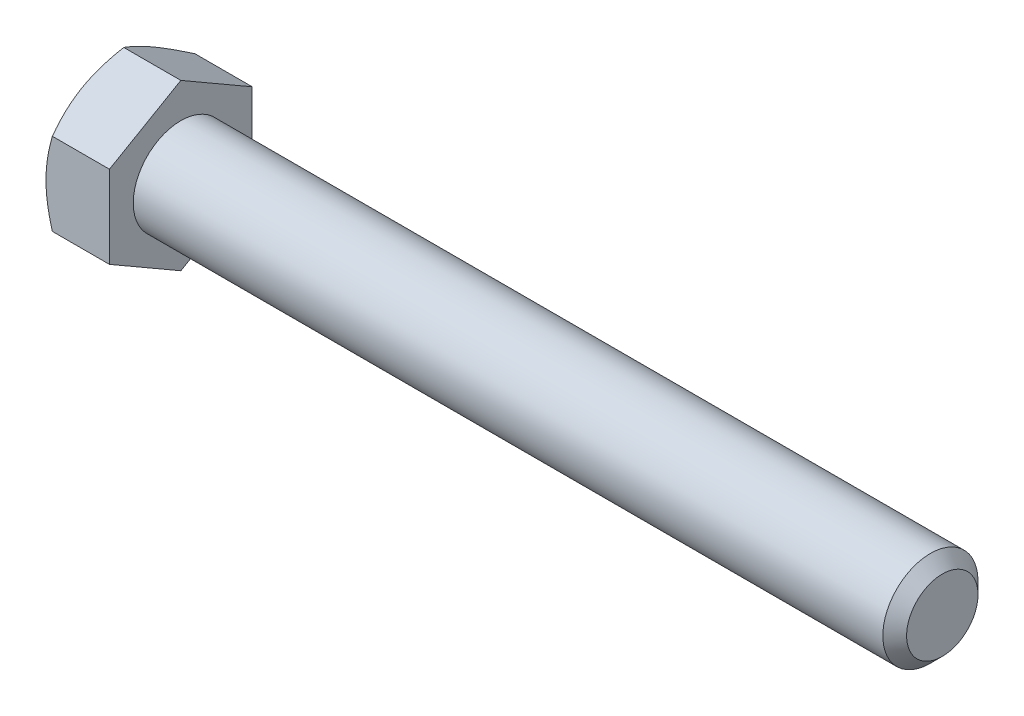
ISO-10303-21;
HEADER;
FILE_DESCRIPTION(('STEP AP214'),'2;1');
FILE_NAME('part.step','',(''),(''),'','','');
FILE_SCHEMA(('AUTOMOTIVE_DESIGN { 1 0 10303 214 1 1 1 1 }'));
ENDSEC;
DATA;
#1=APPLICATION_CONTEXT('core data for automotive mechanical design processes');
#2=APPLICATION_PROTOCOL_DEFINITION('international standard','automotive_design',2000,#1);
#3=PRODUCT_CONTEXT('',#1,'mechanical');
#4=PRODUCT('Part','Part','',(#3));
#5=PRODUCT_RELATED_PRODUCT_CATEGORY('part','',(#4));
#6=PRODUCT_DEFINITION_FORMATION('','',#4);
#7=PRODUCT_DEFINITION_CONTEXT('part definition',#1,'design');
#8=PRODUCT_DEFINITION('design','',#6,#7);
#9=PRODUCT_DEFINITION_SHAPE('','',#8);
#10=(LENGTH_UNIT() NAMED_UNIT(*) SI_UNIT(.MILLI.,.METRE.));
#11=(NAMED_UNIT(*) PLANE_ANGLE_UNIT() SI_UNIT($,.RADIAN.));
#12=(NAMED_UNIT(*) SI_UNIT($,.STERADIAN.) SOLID_ANGLE_UNIT());
#13=UNCERTAINTY_MEASURE_WITH_UNIT(LENGTH_MEASURE(1.E-05),#10,'distance_accuracy_value','');
#14=(GEOMETRIC_REPRESENTATION_CONTEXT(3) GLOBAL_UNCERTAINTY_ASSIGNED_CONTEXT((#13)) GLOBAL_UNIT_ASSIGNED_CONTEXT((#10,
#11,#12)) REPRESENTATION_CONTEXT('',''));
#15=CARTESIAN_POINT('',(0.,0.,0.));
#16=DIRECTION('',(0.,0.,1.));
#17=DIRECTION('',(1.,0.,0.));
#18=AXIS2_PLACEMENT_3D('',#15,#16,#17);
#19=CARTESIAN_POINT('',(-41.2749999999999,-4.12444598552303,7.14374999999942));
#20=DIRECTION('',(0.,0.,-1.));
#21=DIRECTION('',(0.,1.00000000000002,0.));
#22=AXIS2_PLACEMENT_3D('',#19,#20,#21);
#23=PLANE('',#22);
#24=CARTESIAN_POINT('',(-37.6837107291255,-11.2944476437765,7.14374999999959));
#25=CARTESIAN_POINT('',(-37.8368470181612,-10.9805232394076,7.14374999999949));
#26=CARTESIAN_POINT('',(-37.98857594162,-10.6659008872168,7.14374999999945));
#27=CARTESIAN_POINT('',(-38.2884314864201,-10.0348898213435,7.14374999999943));
#28=CARTESIAN_POINT('',(-38.4365575792034,-9.71850085675981,7.14374999999943));
#29=CARTESIAN_POINT('',(-38.7291194579079,-9.08205743380548,7.14374999999944));
#30=CARTESIAN_POINT('',(-38.8735325502159,-8.76199250898865,7.14374999999944));
#31=CARTESIAN_POINT('',(-39.156729056574,-8.11939096179736,7.14374999999943));
#32=CARTESIAN_POINT('',(-39.2955127230965,-7.79685445104332,7.14374999999943));
#33=CARTESIAN_POINT('',(-39.5706162676197,-7.13766604016638,7.14374999999943));
#34=CARTESIAN_POINT('',(-39.706687685096,-6.80090989506943,7.14374999999943));
#35=CARTESIAN_POINT('',(-39.9690446569591,-6.12353919008628,7.14374999999943));
#36=CARTESIAN_POINT('',(-40.0953291440824,-5.78292421402414,7.14374999999942));
#37=CARTESIAN_POINT('',(-40.3349543305283,-5.09786024749846,7.14374999999943));
#38=CARTESIAN_POINT('',(-40.4483194563628,-4.75341989048778,7.14374999999944));
#39=CARTESIAN_POINT('',(-40.6586129161924,-4.05961513378702,7.1437499999994));
#40=CARTESIAN_POINT('',(-40.7555462033471,-3.71025225244295,7.14374999999937));
#41=CARTESIAN_POINT('',(-40.9279472656945,-3.0082907051325,7.14374999999937));
#42=CARTESIAN_POINT('',(-41.0035368409943,-2.65572276057834,7.1437499999994));
#43=CARTESIAN_POINT('',(-41.0977473017323,-2.1234946201424,7.14374999999942));
#44=CARTESIAN_POINT('',(-41.1259563298877,-1.94551103747597,7.14374999999941));
#45=CARTESIAN_POINT('',(-41.1754356720996,-1.58858869612653,7.14374999999941));
#46=CARTESIAN_POINT('',(-41.1967066947933,-1.40965003689224,7.14374999999941));
#47=CARTESIAN_POINT('',(-41.231607916766,-1.05348730697556,7.14374999999941));
#48=CARTESIAN_POINT('',(-41.245338274907,-0.876273093939495,7.1437499999994));
#49=CARTESIAN_POINT('',(-41.2652847155614,-0.521422092230687,7.14374999999941));
#50=CARTESIAN_POINT('',(-41.2715009289902,-0.343785310974173,7.14374999999942));
#51=CARTESIAN_POINT('',(-41.2762697532723,0.0115936241288432,7.14374999999939));
#52=CARTESIAN_POINT('',(-41.2748223313716,0.189335778422458,7.14374999999936));
#53=CARTESIAN_POINT('',(-41.2643014350507,0.544596189801067,7.14374999999944));
#54=CARTESIAN_POINT('',(-41.2552276208028,0.722114436555852,7.14374999999954));
#55=CARTESIAN_POINT('',(-41.2249195257371,1.14231672690758,7.14374999999958));
#56=CARTESIAN_POINT('',(-41.2004249010898,1.38477115846025,7.14374999999945));
#57=CARTESIAN_POINT('',(-41.1384979515934,1.86800860978019,7.14374999999934));
#58=CARTESIAN_POINT('',(-41.1010640485556,2.10879142200594,7.14374999999938));
#59=CARTESIAN_POINT('',(-40.9713280647366,2.82827840354016,7.14374999999943));
#60=CARTESIAN_POINT('',(-40.8616106087777,3.3038910668914,7.1437499999994));
#61=CARTESIAN_POINT('',(-40.6696836999775,4.01550298491677,7.14374999999938));
#62=CARTESIAN_POINT('',(-40.6001876580382,4.25514454863067,7.14374999999937));
#63=CARTESIAN_POINT('',(-40.45356361256,4.73210450574067,7.14374999999939));
#64=CARTESIAN_POINT('',(-40.376435548635,4.96942288073888,7.14374999999942));
#65=CARTESIAN_POINT('',(-40.2158189394426,5.44180614696596,7.14374999999934));
#66=CARTESIAN_POINT('',(-40.1323321060847,5.67687162566812,7.14374999999924));
#67=CARTESIAN_POINT('',(-39.9600214111277,6.14502503891593,7.14374999999951));
#68=CARTESIAN_POINT('',(-39.8711976818889,6.37811302234187,7.14374999999989));
#69=CARTESIAN_POINT('',(-39.620948189305,7.01633974983241,7.1437500000002));
#70=CARTESIAN_POINT('',(-39.4549401417686,7.41968025407103,7.14374999999959));
#71=CARTESIAN_POINT('',(-39.1128746766822,8.22209357946195,7.14374999999914));
#72=CARTESIAN_POINT('',(-38.9368160495418,8.62116588004319,7.1437499999993));
#73=CARTESIAN_POINT('',(-38.5770756305019,9.41604681837696,7.14374999999942));
#74=CARTESIAN_POINT('',(-38.3933907130704,9.81185403670943,7.14374999999937));
#75=CARTESIAN_POINT('',(-38.0202597306572,10.6007123172169,7.14374999999933));
#76=CARTESIAN_POINT('',(-37.8308139221847,10.9937635011508,7.14374999999934));
#77=CARTESIAN_POINT('',(-37.4471131080571,11.7783335003951,7.14374999999935));
#78=CARTESIAN_POINT('',(-37.252850485674,12.1698485826149,7.14374999999934));
#79=CARTESIAN_POINT('',(-36.8607727676531,12.95109726537,7.14374999999933));
#80=CARTESIAN_POINT('',(-36.6629576395824,13.3408308496001,7.14374999999933));
#81=CARTESIAN_POINT('',(-36.2645317877318,14.11874726817,7.14374999999933));
#82=CARTESIAN_POINT('',(-36.0639217421807,14.5069304503019,7.14374999999933));
#83=CARTESIAN_POINT('',(-35.6603913196845,15.28209480125,7.14374999999932));
#84=CARTESIAN_POINT('',(-35.4574709333836,15.6690759651905,7.14374999999932));
#85=CARTESIAN_POINT('',(-34.8903473303467,16.7442233759682,7.14374999999931));
#86=CARTESIAN_POINT('',(-34.5240917630895,17.4313067825056,7.14374999999931));
#87=CARTESIAN_POINT('',(-33.7872356734757,18.8031936251549,7.14374999999931));
#88=CARTESIAN_POINT('',(-33.41663486271,19.4879969060092,7.14374999999931));
#89=CARTESIAN_POINT('',(-32.6735201430144,20.8534506388632,7.14374999999928));
#90=CARTESIAN_POINT('',(-32.3010175066131,21.5341072316463,7.14374999999924));
#91=CARTESIAN_POINT('',(-31.5535551210311,22.8939962458754,7.14374999999932));
#92=CARTESIAN_POINT('',(-31.1785955803171,23.5732287818583,7.14374999999944));
#93=CARTESIAN_POINT('',(-30.8027458985241,24.2519647910628,7.14374999999973));
#94=B_SPLINE_CURVE_WITH_KNOTS('',3,(#24,#25,#26,#27,#28,#29,#30,#31,#32,#33,#34,#35,#36,#37,#38,
#39,#40,#41,#42,#43,#44,#45,#46,#47,#48,#49,#50,#51,#52,#53,#54,#55,#56,#57,#58,#59,#60,#61,#62,
#63,#64,#65,#66,#67,#68,#69,#70,#71,#72,#73,#74,#75,#76,#77,#78,#79,#80,#81,#82,#83,#84,#85,#86,
#87,#88,#89,#90,#91,#92,#93),.UNSPECIFIED.,.F.,.F.,(4,2,2,2,2,2,2,2,2,2,2,2,2,2,2,2,2,2,2,2,2,2,
2,2,2,2,2,2,2,2,2,2,2,2,4),(0.,1.04786354483483,2.09587990182195,3.14924522983516,
4.20256326345271,5.29206939195601,6.38169416429086,7.46922336086917,8.55642415101068,
9.63728918942475,10.1777908946972,10.7182373766561,11.2513201674656,11.7843936705004,
12.3174694518644,12.8505689880339,13.5812265935346,14.3119733479513,15.7741561909282,
16.5226328217039,17.2711153750585,18.0193971292237,18.7676603329387,20.0759569450824,
21.3844113444439,22.6934073945108,24.0023452453696,25.3135047056323,26.6246761423154,
27.9355347616117,29.2463986911018,31.5821913644606,33.9181399602317,36.2458936638363,
38.5734523528295),.UNSPECIFIED.);
#95=CARTESIAN_POINT('',(-40.6369459855236,-4.12444598552247,7.14374999999951));
#96=VERTEX_POINT('',#95);
#97=CARTESIAN_POINT('',(-41.2749999999999,-8.32667268468867E-13,7.14374999999973));
#98=VERTEX_POINT('',#97);
#99=EDGE_CURVE('E257',#96,#98,#94,.T.);
#100=ORIENTED_EDGE('',*,*,#99,.F.);
#101=DIRECTION('',(1.,0.,0.));
#102=VECTOR('',#101,1.);
#103=CARTESIAN_POINT('',(-41.2749999999999,-4.12444598552303,7.14374999999942));
#104=LINE('',#103,#102);
#105=CARTESIAN_POINT('',(-34.9250000000001,-4.12444598552256,7.14374999999934));
#106=VERTEX_POINT('',#105);
#107=EDGE_CURVE('E240',#96,#106,#104,.T.);
#108=ORIENTED_EDGE('',*,*,#107,.T.);
#109=DIRECTION('',(0.,1.00000000000002,0.));
#110=VECTOR('',#109,1.);
#111=CARTESIAN_POINT('',(-34.9250000000001,-4.12444598552256,7.14374999999934));
#112=LINE('',#111,#110);
#113=CARTESIAN_POINT('',(-34.9250000000001,4.12444598552314,7.14374999999956));
#114=VERTEX_POINT('',#113);
#115=EDGE_CURVE('E255',#106,#114,#112,.T.);
#116=ORIENTED_EDGE('',*,*,#115,.T.);
#117=DIRECTION('',(1.,0.,0.));
#118=VECTOR('',#117,1.);
#119=CARTESIAN_POINT('',(-41.2749999999999,4.12444598552317,7.14374999999956));
#120=LINE('',#119,#118);
#121=CARTESIAN_POINT('',(-40.6369459855236,4.12444598552317,7.14374999999956));
#122=VERTEX_POINT('',#121);
#123=EDGE_CURVE('E231',#122,#114,#120,.T.);
#124=ORIENTED_EDGE('',*,*,#123,.F.);
#125=EDGE_CURVE('E111',#98,#122,#94,.T.);
#126=ORIENTED_EDGE('',*,*,#125,.F.);
#127=EDGE_LOOP('',(#100,#108,#116,#124,#126));
#128=FACE_BOUND('',#127,.T.);
#129=ADVANCED_FACE('F35',(#128),#23,.F.);
#130=CARTESIAN_POINT('',(-41.2749999999999,4.12444598552317,7.14374999999956));
#131=DIRECTION('',(0.,-0.866025403784456,-0.500000000000004));
#132=DIRECTION('',(0.,0.500000000000005,-0.866025403784436));
#133=AXIS2_PLACEMENT_3D('',#130,#131,#132);
#134=PLANE('',#133);
#135=CARTESIAN_POINT('',(-40.636879317457,4.12433051547084,7.14394999999832));
#136=CARTESIAN_POINT('',(-40.6892139685507,4.21499047493846,6.9869223439874));
#137=CARTESIAN_POINT('',(-40.7391734741417,4.3059884585628,6.82930921296334));
#138=CARTESIAN_POINT('',(-40.8336880324695,4.48872342670462,6.51280296382195));
#139=CARTESIAN_POINT('',(-40.878240753799,4.58046071195529,6.35390932481944));
#140=CARTESIAN_POINT('',(-41.0029142378897,4.85714139103254,5.87468433118512));
#141=CARTESIAN_POINT('',(-41.0738270900452,5.04317693592565,5.55246131541644));
#142=CARTESIAN_POINT('',(-41.156980761404,5.3215757430529,5.07026043670541));
#143=CARTESIAN_POINT('',(-41.1806688344444,5.41310718327038,4.91172333175877));
#144=CARTESIAN_POINT('',(-41.2203902768654,5.59658364372472,4.59393278025901));
#145=CARTESIAN_POINT('',(-41.2364243225764,5.68852862669483,4.43467939825381));
#146=CARTESIAN_POINT('',(-41.260429077992,5.87257827929412,4.11589604883619));
#147=CARTESIAN_POINT('',(-41.2684089385873,5.96468264833026,3.95636660206621));
#148=CARTESIAN_POINT('',(-41.2761427757086,6.14897138013526,3.63716915531839));
#149=CARTESIAN_POINT('',(-41.2758970063578,6.24115574034488,3.47750115977329));
#150=CARTESIAN_POINT('',(-41.2639170896092,6.49371006632251,3.0400642355097));
#151=CARTESIAN_POINT('',(-41.2438063788558,6.65399735752992,2.76243850332894));
#152=CARTESIAN_POINT('',(-41.1800354932582,6.97350732659321,2.20903100338517));
#153=CARTESIAN_POINT('',(-41.1363535225353,7.13272888080871,1.93325118182442));
#154=CARTESIAN_POINT('',(-41.0271614095442,7.45288184700073,1.37872997818619));
#155=CARTESIAN_POINT('',(-40.9611886381128,7.61377286233259,1.10005856514974));
#156=CARTESIAN_POINT('',(-40.8114571178427,7.93315557291998,0.546871483353718));
#157=CARTESIAN_POINT('',(-40.7277335396251,8.09165135831619,0.272348730262679));
#158=CARTESIAN_POINT('',(-40.6368793174574,8.2490074411023,-0.000200000000616374));
#159=B_SPLINE_CURVE_WITH_KNOTS('',3,(#135,#136,#137,#138,#139,#140,#141,#142,#143,#144,#145,
#146,#147,#148,#149,#150,#151,#152,#153,#154,#155,#156,#157,#158),.UNSPECIFIED.,.F.,.F.,(4,2,2,
2,2,2,2,2,2,2,2,4),(0.,0.566119481837862,1.13248221370988,2.26756105798083,2.82119915822918,
3.37478832846287,3.92774781910419,4.48069022658309,5.44329448766759,6.40679037901621,
7.3916551448295,8.37458648302816),.UNSPECIFIED.);
#160=CARTESIAN_POINT('',(-41.2750000000004,6.18666897828535,3.57187500000106));
#161=VERTEX_POINT('',#160);
#162=EDGE_CURVE('E107',#122,#161,#159,.T.);
#163=ORIENTED_EDGE('',*,*,#162,.F.);
#164=ORIENTED_EDGE('',*,*,#123,.T.);
#165=DIRECTION('',(0.,0.500000000000005,-0.866025403784436));
#166=VECTOR('',#165,1.);
#167=CARTESIAN_POINT('',(-34.9250000000001,4.12444598552314,7.14374999999956));
#168=LINE('',#167,#166);
#169=CARTESIAN_POINT('',(-34.9250000000005,8.24889197104714,-1.69309011255336E-12));
#170=VERTEX_POINT('',#169);
#171=EDGE_CURVE('E254',#114,#170,#168,.T.);
#172=ORIENTED_EDGE('',*,*,#171,.T.);
#173=DIRECTION('',(1.,0.,0.));
#174=VECTOR('',#173,1.);
#175=CARTESIAN_POINT('',(-41.2750000000004,8.24889197104767,-1.16573417585641E-12));
#176=LINE('',#175,#174);
#177=CARTESIAN_POINT('',(-40.636945985524,8.24889197104767,-1.16573417585641E-12));
#178=VERTEX_POINT('',#177);
#179=EDGE_CURVE('E130',#178,#170,#176,.T.);
#180=ORIENTED_EDGE('',*,*,#179,.F.);
#181=EDGE_CURVE('E115',#161,#178,#159,.T.);
#182=ORIENTED_EDGE('',*,*,#181,.F.);
#183=EDGE_LOOP('',(#163,#164,#172,#180,#182));
#184=FACE_BOUND('',#183,.T.);
#185=ADVANCED_FACE('F128',(#184),#134,.F.);
#186=CARTESIAN_POINT('',(-41.2750000000004,8.24889197104767,-1.16573417585641E-12));
#187=DIRECTION('',(0.,-0.866025403784453,0.499999999999997));
#188=DIRECTION('',(0.,-0.500000000000014,-0.866025403784441));
#189=AXIS2_PLACEMENT_3D('',#186,#187,#188);
#190=PLANE('',#189);
#191=CARTESIAN_POINT('',(-40.6368793174574,8.2490074411001,0.00019999999945064));
#192=CARTESIAN_POINT('',(-40.6892139685504,8.15834748163288,-0.156827656011842));
#193=CARTESIAN_POINT('',(-40.7391734741412,8.06734949800872,-0.314440787036039));
#194=CARTESIAN_POINT('',(-40.8336880324688,7.88461452986706,-0.630947036177492));
#195=CARTESIAN_POINT('',(-40.8782407537983,7.79287724461637,-0.78984067517992));
#196=CARTESIAN_POINT('',(-41.0029142378891,7.51619656553909,-1.26906566881412));
#197=CARTESIAN_POINT('',(-41.0738270900445,7.33016102064603,-1.59128868458282));
#198=CARTESIAN_POINT('',(-41.1569807614033,7.05176221351881,-2.07348956329383));
#199=CARTESIAN_POINT('',(-41.1806688344437,6.96023077330134,-2.23202666824045));
#200=CARTESIAN_POINT('',(-41.2203902768647,6.77675431284702,-2.54981721974019));
#201=CARTESIAN_POINT('',(-41.2364243225758,6.68480932987693,-2.70907060174539));
#202=CARTESIAN_POINT('',(-41.2604290779912,6.50075967727762,-3.02785395116295));
#203=CARTESIAN_POINT('',(-41.2684089385865,6.40865530824145,-3.18738339793288));
#204=CARTESIAN_POINT('',(-41.2761427757081,6.22436657643662,-3.50658084468072));
#205=CARTESIAN_POINT('',(-41.2758970063577,6.13218221622721,-3.66624884022591));
#206=CARTESIAN_POINT('',(-41.2639170896094,5.87962789024977,-4.10368576448954));
#207=CARTESIAN_POINT('',(-41.2438063788554,5.71934059904207,-4.38131149667008));
#208=CARTESIAN_POINT('',(-41.1800354932574,5.39983062997856,-4.93471899661372));
#209=CARTESIAN_POINT('',(-41.1363535225347,5.24060907576315,-5.21049881817454));
#210=CARTESIAN_POINT('',(-41.0271614095437,4.92045610957117,-5.76502002181281));
#211=CARTESIAN_POINT('',(-40.9611886381122,4.75956509423928,-6.04369143484925));
#212=CARTESIAN_POINT('',(-40.8114571178423,4.4401823836519,-6.5968785166453));
#213=CARTESIAN_POINT('',(-40.7277335396249,4.28168659825571,-6.87140126973639));
#214=CARTESIAN_POINT('',(-40.6368793174579,4.12433051546973,-7.1439499999999));
#215=B_SPLINE_CURVE_WITH_KNOTS('',3,(#191,#192,#193,#194,#195,#196,#197,#198,#199,#200,#201,
#202,#203,#204,#205,#206,#207,#208,#209,#210,#211,#212,#213,#214),.UNSPECIFIED.,.F.,.F.,(4,2,2,
2,2,2,2,2,2,2,2,4),(0.,0.566119481837716,1.13248221370961,2.26756105798048,2.82119915822879,
3.37478832846243,3.92774781910367,4.48069022658247,5.44329448766693,6.40679037901557,
7.3916551448289,8.37458648302746),.UNSPECIFIED.);
#216=CARTESIAN_POINT('',(-41.2750000000004,6.18666897828618,-3.5718750000012));
#217=VERTEX_POINT('',#216);
#218=EDGE_CURVE('E120',#178,#217,#215,.T.);
#219=ORIENTED_EDGE('',*,*,#218,.F.);
#220=ORIENTED_EDGE('',*,*,#179,.T.);
#221=DIRECTION('',(0.,-0.500000000000011,-0.866025403784441));
#222=VECTOR('',#221,1.);
#223=CARTESIAN_POINT('',(-34.9250000000005,8.24889197104714,-1.69309011255336E-12));
#224=LINE('',#223,#222);
#225=CARTESIAN_POINT('',(-34.925000000001,4.12444598552328,-7.14375000000103));
#226=VERTEX_POINT('',#225);
#227=EDGE_CURVE('E251',#170,#226,#224,.T.);
#228=ORIENTED_EDGE('',*,*,#227,.T.);
#229=DIRECTION('',(1.,0.,0.));
#230=VECTOR('',#229,1.);
#231=CARTESIAN_POINT('',(-41.2750000000008,4.12444598552408,-7.14375000000125));
#232=LINE('',#231,#230);
#233=CARTESIAN_POINT('',(-40.6369459855245,4.12444598552403,-7.1437500000012));
#234=VERTEX_POINT('',#233);
#235=EDGE_CURVE('E234',#234,#226,#232,.T.);
#236=ORIENTED_EDGE('',*,*,#235,.F.);
#237=EDGE_CURVE('E131',#217,#234,#215,.T.);
#238=ORIENTED_EDGE('',*,*,#237,.F.);
#239=EDGE_LOOP('',(#219,#220,#228,#236,#238));
#240=FACE_BOUND('',#239,.T.);
#241=ADVANCED_FACE('F191',(#240),#190,.F.);
#242=CARTESIAN_POINT('',(-41.2750000000008,4.12444598552408,-7.14375000000125));
#243=DIRECTION('',(0.,0.,1.));
#244=DIRECTION('',(0.,-1.00000000000002,0.));
#245=AXIS2_PLACEMENT_3D('',#242,#243,#244);
#246=PLANE('',#245);
#247=CARTESIAN_POINT('',(-37.6837107351415,-11.2944476314464,-7.14375000000053));
#248=CARTESIAN_POINT('',(-37.836847023927,-10.980523227493,-7.14375000000096));
#249=CARTESIAN_POINT('',(-37.9885759471356,-10.6659008757177,-7.14375000000113));
#250=CARTESIAN_POINT('',(-38.2884314914365,-10.0348898106769,-7.14375000000126));
#251=CARTESIAN_POINT('',(-38.4365575839708,-9.71850084651009,-7.14375000000122));
#252=CARTESIAN_POINT('',(-38.7291194621772,-9.08205742439561,-7.14375000000119));
#253=CARTESIAN_POINT('',(-38.8735325542361,-8.7619925000018,-7.1437500000012));
#254=CARTESIAN_POINT('',(-39.1567290601003,-8.11939095365936,-7.14375000000121));
#255=CARTESIAN_POINT('',(-39.2955127263778,-7.79685444333116,-7.14375000000121));
#256=CARTESIAN_POINT('',(-39.5706162704031,-7.1376660333404,-7.14375000000121));
#257=CARTESIAN_POINT('',(-39.706687687627,-6.8009098887041,-7.14375000000123));
#258=CARTESIAN_POINT('',(-39.9690446589988,-6.12353918464954,-7.1437500000012));
#259=CARTESIAN_POINT('',(-40.095329145883,-5.78292420905534,-7.14375000000116));
#260=CARTESIAN_POINT('',(-40.334954331873,-5.09786024347416,-7.14375000000127));
#261=CARTESIAN_POINT('',(-40.4483194574908,-4.75341988694001,-7.14375000000143));
#262=CARTESIAN_POINT('',(-40.6586129169219,-4.05961513120525,-7.14375000000101));
#263=CARTESIAN_POINT('',(-40.755546203895,-3.71025225035064,-7.14375000000043));
#264=CARTESIAN_POINT('',(-40.9279472658742,-3.00829070426633,-7.14375000000047));
#265=CARTESIAN_POINT('',(-41.003536841001,-2.65572276045225,-7.14375000000109));
#266=CARTESIAN_POINT('',(-41.0977473015631,-2.12349462113995,-7.1437500000013));
#267=CARTESIAN_POINT('',(-41.1259563296738,-1.94551103885019,-7.14375000000125));
#268=CARTESIAN_POINT('',(-41.175435671827,-1.5885886982574,-7.14375000000121));
#269=CARTESIAN_POINT('',(-41.1967066945069,-1.4096500394031,-7.14375000000122));
#270=CARTESIAN_POINT('',(-41.2316079164855,-1.0534873102385,-7.14375000000124));
#271=CARTESIAN_POINT('',(-41.2453382746457,-0.876273097574476,-7.14375000000125));
#272=CARTESIAN_POINT('',(-41.2652847153717,-0.521422096609208,-7.14375000000122));
#273=CARTESIAN_POINT('',(-41.2715009288528,-0.343785315724191,-7.14375000000119));
#274=CARTESIAN_POINT('',(-41.2762697532717,0.0115936186384432,-7.14375000000128));
#275=CARTESIAN_POINT('',(-41.2748223314556,0.189335772563172,-7.14375000000142));
#276=CARTESIAN_POINT('',(-41.2643014353349,0.54459618320875,-7.14375000000106));
#277=CARTESIAN_POINT('',(-41.2552276212028,0.722114429599388,-7.14375000000056));
#278=CARTESIAN_POINT('',(-41.22491952642,1.14231671939618,-7.14375000000036));
#279=CARTESIAN_POINT('',(-41.2004249019341,1.38477115075958,-7.143750000001));
#280=CARTESIAN_POINT('',(-41.1384979527699,1.86800860170987,-7.14375000000149));
#281=CARTESIAN_POINT('',(-41.101064049903,2.10879141375525,-7.14375000000133));
#282=CARTESIAN_POINT('',(-40.9713280665999,2.8282783947585,-7.14375000000108));
#283=CARTESIAN_POINT('',(-40.8616106109889,3.30389105777015,-7.14375000000121));
#284=CARTESIAN_POINT('',(-40.6696837027017,4.01550297528769,-7.14375000000127));
#285=CARTESIAN_POINT('',(-40.6001876609346,4.25514453882855,-7.14375000000127));
#286=CARTESIAN_POINT('',(-40.4535636157954,4.73210449559453,-7.14375000000124));
#287=CARTESIAN_POINT('',(-40.376435552037,4.96942287042177,-7.14375000000123));
#288=CARTESIAN_POINT('',(-40.2158189431717,5.44180613630817,-7.14375000000129));
#289=CARTESIAN_POINT('',(-40.1323321099742,5.67687161484062,-7.14375000000138));
#290=CARTESIAN_POINT('',(-39.9600214153328,6.14502502774922,-7.14375000000115));
#291=CARTESIAN_POINT('',(-39.8711976862491,6.37811301100565,-7.14375000000082));
#292=CARTESIAN_POINT('',(-39.6209481939362,7.01633973840469,-7.14375000000056));
#293=CARTESIAN_POINT('',(-39.4549401464971,7.41968024271564,-7.14375000000108));
#294=CARTESIAN_POINT('',(-39.1128746815768,8.22209356824213,-7.14375000000147));
#295=CARTESIAN_POINT('',(-38.9368160545053,8.62116586888657,-7.14375000000133));
#296=CARTESIAN_POINT('',(-38.5770756355821,9.41604680733993,-7.14375000000123));
#297=CARTESIAN_POINT('',(-38.3933907181984,9.81185402572877,-7.14375000000127));
#298=CARTESIAN_POINT('',(-38.0202597358661,10.6007123063428,-7.1437500000013));
#299=CARTESIAN_POINT('',(-37.8308139274267,10.9937634903269,-7.1437500000013));
#300=CARTESIAN_POINT('',(-37.4471131133532,11.7783334896704,-7.14375000000129));
#301=CARTESIAN_POINT('',(-37.252850490991,12.1698485719392,-7.1437500000013));
#302=CARTESIAN_POINT('',(-36.8607727730038,12.9510972547886,-7.1437500000013));
#303=CARTESIAN_POINT('',(-36.662957644946,13.340830839064,-7.14375000000131));
#304=CARTESIAN_POINT('',(-36.2645317931156,14.1187472577212,-7.14375000000131));
#305=CARTESIAN_POINT('',(-36.0639217475718,14.5069304398951,-7.14375000000131));
#306=CARTESIAN_POINT('',(-35.6603913250855,15.2820947909249,-7.14375000000132));
#307=CARTESIAN_POINT('',(-35.4574709387874,15.6690759549051,-7.14375000000132));
#308=CARTESIAN_POINT('',(-34.8903473357887,16.7442233657237,-7.14375000000132));
#309=CARTESIAN_POINT('',(-34.5240917685639,17.4313067722606,-7.14375000000133));
#310=CARTESIAN_POINT('',(-33.7872356790082,18.8031936149061,-7.14375000000133));
#311=CARTESIAN_POINT('',(-33.4166348682683,19.487996895757,-7.14375000000132));
#312=CARTESIAN_POINT('',(-32.6735201486262,20.85345062859,-7.14375000000137));
#313=CARTESIAN_POINT('',(-32.3010175122526,21.5341072213557,-7.14375000000142));
#314=CARTESIAN_POINT('',(-31.5535551267234,22.8939962355481,-7.14375000000129));
#315=CARTESIAN_POINT('',(-31.1785955860345,23.5732287715118,-7.1437500000011));
#316=CARTESIAN_POINT('',(-30.8027459042659,24.2519647806967,-7.14375000000064));
#317=B_SPLINE_CURVE_WITH_KNOTS('',3,(#247,#248,#249,#250,#251,#252,#253,#254,#255,#256,#257,
#258,#259,#260,#261,#262,#263,#264,#265,#266,#267,#268,#269,#270,#271,#272,#273,#274,#275,#276,
#277,#278,#279,#280,#281,#282,#283,#284,#285,#286,#287,#288,#289,#290,#291,#292,#293,#294,#295,
#296,#297,#298,#299,#300,#301,#302,#303,#304,#305,#306,#307,#308,#309,#310,#311,#312,#313,#314,
#315,#316),.UNSPECIFIED.,.F.,.F.,(4,2,2,2,2,2,2,2,2,2,2,2,2,2,2,2,2,2,2,2,2,2,2,2,2,2,2,2,2,2,2,
2,2,2,4),(0.,1.04786354338569,2.09587989892348,3.14924522547266,4.20256325762628,
5.2920693845648,6.38169415533437,7.46922335035224,8.55642413893448,9.63728917507433,
10.1777908792105,10.7182373600335,11.2513201497356,11.7843936516632,12.3174694319196,
12.8505689669812,13.5812265718687,14.3119733256721,15.7741561674198,16.5226327975527,
17.2711153502647,18.0193971037889,18.7676603068628,20.0759569190951,21.384411318546,
22.6934073687058,24.002345219657,25.3135046800233,26.62467611681,27.9355347362081,29.2463986658,
31.582191339112,33.9181399348371,36.2458936383558,38.5734523272621),.UNSPECIFIED.);
#318=CARTESIAN_POINT('',(-41.2750000000008,1.49880108324396E-12,-7.14374999999975));
#319=VERTEX_POINT('',#318);
#320=EDGE_CURVE('E185',#234,#319,#317,.F.);
#321=ORIENTED_EDGE('',*,*,#320,.F.);
#322=ORIENTED_EDGE('',*,*,#235,.T.);
#323=DIRECTION('',(0.,-1.00000000000002,0.));
#324=VECTOR('',#323,1.);
#325=CARTESIAN_POINT('',(-34.925000000001,4.12444598552328,-7.14375000000103));
#326=LINE('',#325,#324);
#327=CARTESIAN_POINT('',(-34.925000000001,-4.12444598552389,-7.14374999999987));
#328=VERTEX_POINT('',#327);
#329=EDGE_CURVE('E248',#226,#328,#326,.T.);
#330=ORIENTED_EDGE('',*,*,#329,.T.);
#331=DIRECTION('',(1.,0.,0.));
#332=VECTOR('',#331,1.);
#333=CARTESIAN_POINT('',(-41.2750000000008,-4.12444598552389,-7.14374999999987));
#334=LINE('',#333,#332);
#335=CARTESIAN_POINT('',(-40.6369459855245,-4.12444598552389,-7.14374999999987));
#336=VERTEX_POINT('',#335);
#337=EDGE_CURVE('E236',#336,#328,#334,.T.);
#338=ORIENTED_EDGE('',*,*,#337,.F.);
#339=EDGE_CURVE('E179',#319,#336,#317,.F.);
#340=ORIENTED_EDGE('',*,*,#339,.F.);
#341=EDGE_LOOP('',(#321,#322,#330,#338,#340));
#342=FACE_BOUND('',#341,.T.);
#343=ADVANCED_FACE('F187',(#342),#246,.F.);
#344=CARTESIAN_POINT('',(-41.2750000000008,-4.12444598552389,-7.14374999999987));
#345=DIRECTION('',(0.,0.866025403784455,0.500000000000003));
#346=DIRECTION('',(0.,-0.500000000000005,0.866025403784436));
#347=AXIS2_PLACEMENT_3D('',#344,#345,#346);
#348=PLANE('',#347);
#349=CARTESIAN_POINT('',(-40.6368793174579,-4.12433051547048,-7.14395000000043));
#350=CARTESIAN_POINT('',(-40.6892139685505,-4.21499047493826,-6.98692234398928));
#351=CARTESIAN_POINT('',(-40.7391734741411,-4.30598845856267,-6.82930921296512));
#352=CARTESIAN_POINT('',(-40.8336880324685,-4.48872342670454,-6.51280296382365));
#353=CARTESIAN_POINT('',(-40.8782407537981,-4.58046071195519,-6.35390932482117));
#354=CARTESIAN_POINT('',(-41.002914237889,-4.85714139103247,-5.87468433118679));
#355=CARTESIAN_POINT('',(-41.0738270900443,-5.04317693592564,-5.552461315418));
#356=CARTESIAN_POINT('',(-41.1569807614031,-5.32157574305297,-5.07026043670685));
#357=CARTESIAN_POINT('',(-41.1806688344435,-5.41310718327048,-4.91172333176017));
#358=CARTESIAN_POINT('',(-41.2203902768644,-5.59658364372483,-4.59393278026034));
#359=CARTESIAN_POINT('',(-41.2364243225755,-5.68852862669493,-4.43467939825508));
#360=CARTESIAN_POINT('',(-41.2604290779909,-5.87257827929435,-4.11589604883747));
#361=CARTESIAN_POINT('',(-41.2684089385861,-5.96468264833063,-3.95636660206755));
#362=CARTESIAN_POINT('',(-41.2761427757078,-6.14897138013527,-3.6371691553195));
#363=CARTESIAN_POINT('',(-41.2758970063576,-6.24115574034439,-3.4775011597741));
#364=CARTESIAN_POINT('',(-41.2639170896095,-6.49371006632155,-3.04006423551039));
#365=CARTESIAN_POINT('',(-41.243806378855,-6.65399735752969,-2.76243850333024));
#366=CARTESIAN_POINT('',(-41.1800354932566,-6.97350732659343,-2.20903100338699));
#367=CARTESIAN_POINT('',(-41.136353522534,-7.13272888080864,-1.93325118182615));
#368=CARTESIAN_POINT('',(-41.0271614095431,-7.45288184700053,-1.37872997818804));
#369=CARTESIAN_POINT('',(-40.9611886381116,-7.61377286233254,-1.10005856515178));
#370=CARTESIAN_POINT('',(-40.8114571178417,-7.93315557291949,-0.546871483355701));
#371=CARTESIAN_POINT('',(-40.7277335396244,-8.09165135831509,-0.272348730264394));
#372=CARTESIAN_POINT('',(-40.6368793174574,-8.24900744109963,0.000199999999839218));
#373=B_SPLINE_CURVE_WITH_KNOTS('',3,(#349,#350,#351,#352,#353,#354,#355,#356,#357,#358,#359,
#360,#361,#362,#363,#364,#365,#366,#367,#368,#369,#370,#371,#372),.UNSPECIFIED.,.F.,.F.,(4,2,2,
2,2,2,2,2,2,2,2,4),(0.,0.566119481837838,1.13248221370986,2.26756105798109,2.82119915822956,
3.37478832846336,3.92774781910474,4.48069022658364,5.4432944876678,6.40679037901615,
7.39165514482922,8.37458648302745),.UNSPECIFIED.);
#374=CARTESIAN_POINT('',(-41.2750000000004,-6.18666897828518,-3.57187500000083));
#375=VERTEX_POINT('',#374);
#376=EDGE_CURVE('E186',#336,#375,#373,.T.);
#377=ORIENTED_EDGE('',*,*,#376,.F.);
#378=ORIENTED_EDGE('',*,*,#337,.T.);
#379=DIRECTION('',(0.,-0.500000000000005,0.866025403784436));
#380=VECTOR('',#379,1.);
#381=CARTESIAN_POINT('',(-34.925000000001,-4.12444598552389,-7.14374999999987));
#382=LINE('',#381,#380);
#383=CARTESIAN_POINT('',(-34.9250000000005,-8.24889197104667,-3.05311331771918E-13));
#384=VERTEX_POINT('',#383);
#385=EDGE_CURVE('E245',#328,#384,#382,.T.);
#386=ORIENTED_EDGE('',*,*,#385,.T.);
#387=DIRECTION('',(1.,0.,0.));
#388=VECTOR('',#387,1.);
#389=CARTESIAN_POINT('',(-41.2750000000004,-8.24889197104692,-2.33146835171283E-12));
#390=LINE('',#389,#388);
#391=CARTESIAN_POINT('',(-40.636945985524,-8.24889197104844,-2.77555756156289E-13));
#392=VERTEX_POINT('',#391);
#393=EDGE_CURVE('E238',#392,#384,#390,.T.);
#394=ORIENTED_EDGE('',*,*,#393,.F.);
#395=EDGE_CURVE('E173',#375,#392,#373,.T.);
#396=ORIENTED_EDGE('',*,*,#395,.F.);
#397=EDGE_LOOP('',(#377,#378,#386,#394,#396));
#398=FACE_BOUND('',#397,.T.);
#399=ADVANCED_FACE('F190',(#398),#348,.F.);
#400=CARTESIAN_POINT('',(-41.2750000000004,-8.24889197104692,-2.33146835171283E-12));
#401=DIRECTION('',(0.,0.866025403784453,-0.499999999999997));
#402=DIRECTION('',(0.,0.500000000000014,0.866025403784441));
#403=AXIS2_PLACEMENT_3D('',#400,#401,#402);
#404=PLANE('',#403);
#405=CARTESIAN_POINT('',(-40.6368793174574,-8.24900744110205,-0.000200000001865375));
#406=CARTESIAN_POINT('',(-40.68921396855,-8.15834748163311,0.156827656008759));
#407=CARTESIAN_POINT('',(-40.7391734741406,-8.06734949800818,0.314440787032744));
#408=CARTESIAN_POINT('',(-40.8336880324682,-7.88461452986585,0.630947036174195));
#409=CARTESIAN_POINT('',(-40.8782407537978,-7.79287724461526,0.789840675176833));
#410=CARTESIAN_POINT('',(-41.0029142378889,-7.51619656553803,1.26906566881156));
#411=CARTESIAN_POINT('',(-41.0738270900443,-7.33016102064469,1.59128868458047));
#412=CARTESIAN_POINT('',(-41.1569807614032,-7.05176221351716,2.07348956329183));
#413=CARTESIAN_POINT('',(-41.1806688344436,-6.96023077329961,2.23202666823858));
#414=CARTESIAN_POINT('',(-41.2203902768647,-6.77675431284521,2.5498172197386));
#415=CARTESIAN_POINT('',(-41.2364243225758,-6.68480932987511,2.70907060174397));
#416=CARTESIAN_POINT('',(-41.2604290779912,-6.50075967727546,3.02785395116167));
#417=CARTESIAN_POINT('',(-41.2684089385865,-6.40865530823895,3.18738339793158));
#418=CARTESIAN_POINT('',(-41.2761427757081,-6.2243665764347,3.5065808446801));
#419=CARTESIAN_POINT('',(-41.2758970063577,-6.13218221622618,3.66624884022597));
#420=CARTESIAN_POINT('',(-41.2639170896094,-5.87962789024954,4.10368576449007));
#421=CARTESIAN_POINT('',(-41.2438063788554,-5.71934059904034,4.38131149666959));
#422=CARTESIAN_POINT('',(-41.1800354932573,-5.39983062997585,4.93471899661232));
#423=CARTESIAN_POINT('',(-41.1363535225346,-5.24060907576096,5.21049881817328));
#424=CARTESIAN_POINT('',(-41.0271614095437,-4.92045610956933,5.76502002181145));
#425=CARTESIAN_POINT('',(-40.9611886381124,-4.75956509423724,6.04369143484764));
#426=CARTESIAN_POINT('',(-40.8114571178423,-4.44018238365031,6.59687851664359));
#427=CARTESIAN_POINT('',(-40.7277335396247,-4.28168659825477,6.87140126973482));
#428=CARTESIAN_POINT('',(-40.636879317457,-4.12433051547065,7.14394999999904));
#429=B_SPLINE_CURVE_WITH_KNOTS('',3,(#405,#406,#407,#408,#409,#410,#411,#412,#413,#414,#415,
#416,#417,#418,#419,#420,#421,#422,#423,#424,#425,#426,#427,#428),.UNSPECIFIED.,.F.,.F.,(4,2,2,
2,2,2,2,2,2,2,2,4),(0.,0.566119481838175,1.13248221371054,2.26756105798237,2.82119915823113,
3.37478832846522,3.9277478191069,4.48069022658614,5.44329448767018,6.4067903790184,
7.39165514483131,8.37458648302946),.UNSPECIFIED.);
#430=CARTESIAN_POINT('',(-41.2750000000004,-6.18666897828521,3.57187499999878));
#431=VERTEX_POINT('',#430);
#432=EDGE_CURVE('E283',#392,#431,#429,.T.);
#433=ORIENTED_EDGE('',*,*,#432,.F.);
#434=ORIENTED_EDGE('',*,*,#393,.T.);
#435=DIRECTION('',(0.,0.500000000000014,0.866025403784441));
#436=VECTOR('',#435,1.);
#437=CARTESIAN_POINT('',(-34.9250000000005,-8.24889197104667,-3.05311331771918E-13));
#438=LINE('',#437,#436);
#439=EDGE_CURVE('E242',#384,#106,#438,.T.);
#440=ORIENTED_EDGE('',*,*,#439,.T.);
#441=ORIENTED_EDGE('',*,*,#107,.F.);
#442=EDGE_CURVE('E125',#431,#96,#429,.T.);
#443=ORIENTED_EDGE('',*,*,#442,.F.);
#444=EDGE_LOOP('',(#433,#434,#440,#441,#443));
#445=FACE_BOUND('',#444,.T.);
#446=ADVANCED_FACE('F212',(#445),#404,.F.);
#447=CARTESIAN_POINT('',(-34.9250000000005,-1.38777878078145E-13,0.));
#448=DIRECTION('',(1.,0.,0.));
#449=DIRECTION('',(0.,0.,-1.));
#450=AXIS2_PLACEMENT_3D('',#447,#448,#449);
#451=CYLINDRICAL_SURFACE('',#450,4.7625);
#452=CARTESIAN_POINT('',(-34.9250000000005,-1.38777878078145E-13,0.));
#453=DIRECTION('',(-1.,0.,0.));
#454=DIRECTION('',(0.,0.,1.));
#455=AXIS2_PLACEMENT_3D('',#452,#453,#454);
#456=CIRCLE('',#455,4.7625);
#457=CARTESIAN_POINT('',(-34.9250000000005,-1.18156873174513E-13,4.76249999999992));
#458=VERTEX_POINT('',#457);
#459=EDGE_CURVE('E221',#458,#458,#456,.F.);
#460=ORIENTED_EDGE('',*,*,#459,.T.);
#461=EDGE_LOOP('',(#460));
#462=FACE_BOUND('',#461,.T.);
#463=CARTESIAN_POINT('',(40.084375,3.33066907387547E-13,0.));
#464=DIRECTION('',(1.,0.,0.));
#465=DIRECTION('',(0.,0.,-1.));
#466=AXIS2_PLACEMENT_3D('',#463,#464,#465);
#467=CIRCLE('',#466,4.7625);
#468=CARTESIAN_POINT('',(40.0843749999999,3.12445902483915E-13,-4.76249999999998));
#469=VERTEX_POINT('',#468);
#470=EDGE_CURVE('E224',#469,#469,#467,.F.);
#471=ORIENTED_EDGE('',*,*,#470,.T.);
#472=EDGE_LOOP('',(#471));
#473=FACE_BOUND('',#472,.T.);
#474=ADVANCED_FACE('F209',(#462,#473),#451,.T.);
#475=CARTESIAN_POINT('',(41.2749999999999,3.33066907387547E-13,0.));
#476=DIRECTION('',(1.,0.,0.));
#477=DIRECTION('',(0.,0.,-1.));
#478=AXIS2_PLACEMENT_3D('',#475,#476,#477);
#479=PLANE('',#478);
#480=CARTESIAN_POINT('',(41.2749999999999,3.33066907387547E-13,0.));
#481=DIRECTION('',(1.,0.,0.));
#482=DIRECTION('',(0.,0.,-1.));
#483=AXIS2_PLACEMENT_3D('',#480,#481,#482);
#484=CIRCLE('',#483,3.571875);
#485=CARTESIAN_POINT('',(41.2749999999999,3.17601153709823E-13,-3.57187499999997));
#486=VERTEX_POINT('',#485);
#487=EDGE_CURVE('E226',#486,#486,#484,.T.);
#488=ORIENTED_EDGE('',*,*,#487,.T.);
#489=EDGE_LOOP('',(#488));
#490=FACE_BOUND('',#489,.T.);
#491=ADVANCED_FACE('F207',(#490),#479,.T.);
#492=CARTESIAN_POINT('',(41.2749999999999,3.33066907387547E-13,0.));
#493=DIRECTION('',(-1.,0.,0.));
#494=DIRECTION('',(0.,0.,1.));
#495=AXIS2_PLACEMENT_3D('',#492,#493,#494);
#496=CONICAL_SURFACE('',#495,3.571875,0.78539816339745);
#497=ORIENTED_EDGE('',*,*,#470,.F.);
#498=EDGE_LOOP('',(#497));
#499=FACE_BOUND('',#498,.T.);
#500=ORIENTED_EDGE('',*,*,#487,.F.);
#501=EDGE_LOOP('',(#500));
#502=FACE_BOUND('',#501,.T.);
#503=ADVANCED_FACE('F37',(#499,#502),#496,.T.);
#504=CARTESIAN_POINT('',(-34.9250000000001,4.12444598552314,7.14374999999956));
#505=DIRECTION('',(-1.,0.,0.));
#506=DIRECTION('',(0.,0.,1.));
#507=AXIS2_PLACEMENT_3D('',#504,#505,#506);
#508=PLANE('',#507);
#509=ORIENTED_EDGE('',*,*,#459,.F.);
#510=EDGE_LOOP('',(#509));
#511=FACE_BOUND('',#510,.T.);
#512=ORIENTED_EDGE('',*,*,#115,.F.);
#513=ORIENTED_EDGE('',*,*,#439,.F.);
#514=ORIENTED_EDGE('',*,*,#385,.F.);
#515=ORIENTED_EDGE('',*,*,#329,.F.);
#516=ORIENTED_EDGE('',*,*,#227,.F.);
#517=ORIENTED_EDGE('',*,*,#171,.F.);
#518=EDGE_LOOP('',(#512,#513,#514,#515,#516,#517));
#519=FACE_BOUND('',#518,.T.);
#520=ADVANCED_FACE('F158',(#511,#519),#508,.F.);
#521=CARTESIAN_POINT('',(-41.2750000000004,1.0547118733939E-12,-6.93889390390723E-13));
#522=DIRECTION('',(1.,0.,0.));
#523=DIRECTION('',(0.,0.,1.));
#524=AXIS2_PLACEMENT_3D('',#521,#522,#523);
#525=CONICAL_SURFACE('',#524,7.14375,1.0471975511966);
#526=ORIENTED_EDGE('',*,*,#99,.T.);
#527=CARTESIAN_POINT('',(-41.2750000000004,1.0547118733939E-12,-6.93889390390723E-13));
#528=DIRECTION('',(-1.,0.,0.));
#529=DIRECTION('',(0.,0.,1.));
#530=AXIS2_PLACEMENT_3D('',#527,#528,#529);
#531=CIRCLE('',#530,7.14375);
#532=EDGE_CURVE('E39',#431,#98,#531,.T.);
#533=ORIENTED_EDGE('',*,*,#532,.F.);
#534=ORIENTED_EDGE('',*,*,#442,.T.);
#535=EDGE_LOOP('',(#526,#533,#534));
#536=FACE_BOUND('',#535,.T.);
#537=ADVANCED_FACE('F153',(#536),#525,.T.);
#538=ORIENTED_EDGE('',*,*,#395,.T.);
#539=ORIENTED_EDGE('',*,*,#432,.T.);
#540=EDGE_CURVE('E59',#375,#431,#531,.T.);
#541=ORIENTED_EDGE('',*,*,#540,.F.);
#542=EDGE_LOOP('',(#538,#539,#541));
#543=FACE_BOUND('',#542,.T.);
#544=ADVANCED_FACE('F157',(#543),#525,.T.);
#545=ORIENTED_EDGE('',*,*,#339,.T.);
#546=ORIENTED_EDGE('',*,*,#376,.T.);
#547=EDGE_CURVE('E277',#319,#375,#531,.T.);
#548=ORIENTED_EDGE('',*,*,#547,.F.);
#549=EDGE_LOOP('',(#545,#546,#548));
#550=FACE_BOUND('',#549,.T.);
#551=ADVANCED_FACE('F278',(#550),#525,.T.);
#552=ORIENTED_EDGE('',*,*,#237,.T.);
#553=ORIENTED_EDGE('',*,*,#320,.T.);
#554=EDGE_CURVE('E44',#217,#319,#531,.T.);
#555=ORIENTED_EDGE('',*,*,#554,.F.);
#556=EDGE_LOOP('',(#552,#553,#555));
#557=FACE_BOUND('',#556,.T.);
#558=ADVANCED_FACE('F274',(#557),#525,.T.);
#559=ORIENTED_EDGE('',*,*,#181,.T.);
#560=ORIENTED_EDGE('',*,*,#218,.T.);
#561=EDGE_CURVE('E12',#161,#217,#531,.T.);
#562=ORIENTED_EDGE('',*,*,#561,.F.);
#563=EDGE_LOOP('',(#559,#560,#562));
#564=FACE_BOUND('',#563,.T.);
#565=ADVANCED_FACE('F118',(#564),#525,.T.);
#566=ORIENTED_EDGE('',*,*,#125,.T.);
#567=ORIENTED_EDGE('',*,*,#162,.T.);
#568=CARTESIAN_POINT('',(-41.2750000000004,1.0547118733939E-12,-6.93889390390723E-13));
#569=DIRECTION('',(-1.,0.,0.));
#570=DIRECTION('',(0.,0.,1.));
#571=AXIS2_PLACEMENT_3D('',#568,#569,#570);
#572=CIRCLE('',#571,7.14375);
#573=EDGE_CURVE('E51',#98,#161,#572,.T.);
#574=ORIENTED_EDGE('',*,*,#573,.F.);
#575=EDGE_LOOP('',(#566,#567,#574));
#576=FACE_BOUND('',#575,.T.);
#577=ADVANCED_FACE('F109',(#576),#525,.T.);
#578=CARTESIAN_POINT('',(-41.2749999999999,4.12444598552317,7.14374999999956));
#579=DIRECTION('',(-1.,0.,0.));
#580=DIRECTION('',(0.,0.,1.));
#581=AXIS2_PLACEMENT_3D('',#578,#579,#580);
#582=PLANE('',#581);
#583=ORIENTED_EDGE('',*,*,#532,.T.);
#584=ORIENTED_EDGE('',*,*,#573,.T.);
#585=ORIENTED_EDGE('',*,*,#561,.T.);
#586=ORIENTED_EDGE('',*,*,#554,.T.);
#587=ORIENTED_EDGE('',*,*,#547,.T.);
#588=ORIENTED_EDGE('',*,*,#540,.T.);
#589=EDGE_LOOP('',(#583,#584,#585,#586,#587,#588));
#590=FACE_BOUND('',#589,.T.);
#591=ADVANCED_FACE('F124',(#590),#582,.T.);
#592=CLOSED_SHELL('',(#129,#185,#241,#343,#399,#446,#474,#491,#503,#520,#537,#544,#551,#558,
#565,#577,#591));
#593=MANIFOLD_SOLID_BREP('B2',#592);
#594=ADVANCED_BREP_SHAPE_REPRESENTATION('',(#18,#593),#14);
#595=SHAPE_DEFINITION_REPRESENTATION(#9,#594);
ENDSEC;
END-ISO-10303-21;
